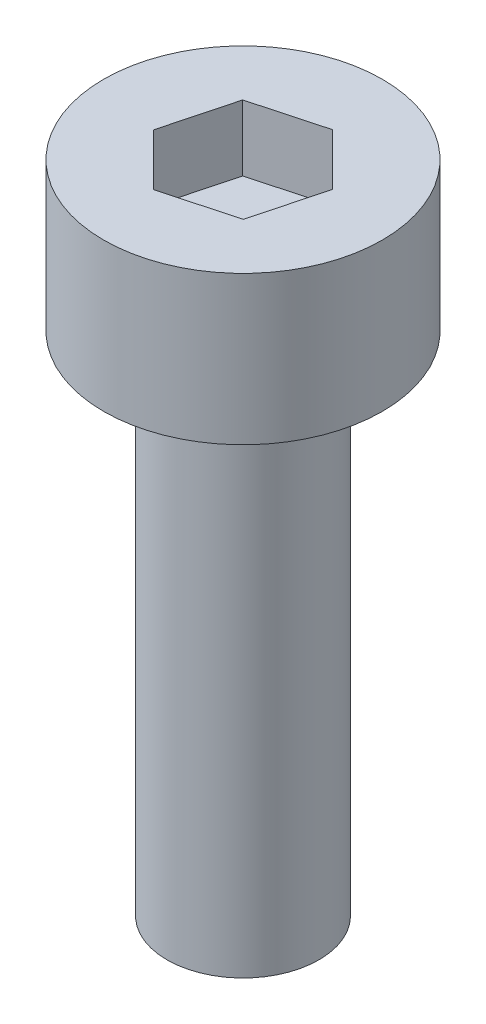
ISO-10303-21;
HEADER;
FILE_DESCRIPTION(('STEP AP214'),'2;1');
FILE_NAME('part.step','',(''),(''),'','','');
FILE_SCHEMA(('AUTOMOTIVE_DESIGN { 1 0 10303 214 1 1 1 1 }'));
ENDSEC;
DATA;
#1=APPLICATION_CONTEXT('core data for automotive mechanical design processes');
#2=APPLICATION_PROTOCOL_DEFINITION('international standard','automotive_design',2000,#1);
#3=PRODUCT_CONTEXT('',#1,'mechanical');
#4=PRODUCT('Part','Part','',(#3));
#5=PRODUCT_RELATED_PRODUCT_CATEGORY('part','',(#4));
#6=PRODUCT_DEFINITION_FORMATION('','',#4);
#7=PRODUCT_DEFINITION_CONTEXT('part definition',#1,'design');
#8=PRODUCT_DEFINITION('design','',#6,#7);
#9=PRODUCT_DEFINITION_SHAPE('','',#8);
#10=(LENGTH_UNIT() NAMED_UNIT(*) SI_UNIT(.MILLI.,.METRE.));
#11=(NAMED_UNIT(*) PLANE_ANGLE_UNIT() SI_UNIT($,.RADIAN.));
#12=(NAMED_UNIT(*) SI_UNIT($,.STERADIAN.) SOLID_ANGLE_UNIT());
#13=UNCERTAINTY_MEASURE_WITH_UNIT(LENGTH_MEASURE(1.E-05),#10,'distance_accuracy_value','');
#14=(GEOMETRIC_REPRESENTATION_CONTEXT(3) GLOBAL_UNCERTAINTY_ASSIGNED_CONTEXT((#13)) GLOBAL_UNIT_ASSIGNED_CONTEXT((#10,
#11,#12)) REPRESENTATION_CONTEXT('',''));
#15=CARTESIAN_POINT('',(0.,0.,0.));
#16=DIRECTION('',(0.,0.,1.));
#17=DIRECTION('',(1.,0.,0.));
#18=AXIS2_PLACEMENT_3D('',#15,#16,#17);
#19=CARTESIAN_POINT('',(0.,10.,0.));
#20=DIRECTION('',(0.,-1.,0.));
#21=DIRECTION('',(0.,0.,-1.));
#22=AXIS2_PLACEMENT_3D('',#19,#20,#21);
#23=CYLINDRICAL_SURFACE('',#22,1.5);
#24=CARTESIAN_POINT('',(0.,10.,0.));
#25=DIRECTION('',(0.,1.,0.));
#26=DIRECTION('',(0.,0.,1.));
#27=AXIS2_PLACEMENT_3D('',#24,#25,#26);
#28=CIRCLE('',#27,1.5);
#29=CARTESIAN_POINT('',(0.,10.,1.5));
#30=VERTEX_POINT('',#29);
#31=EDGE_CURVE('E11',#30,#30,#28,.T.);
#32=ORIENTED_EDGE('',*,*,#31,.F.);
#33=EDGE_LOOP('',(#32));
#34=FACE_BOUND('',#33,.T.);
#35=CARTESIAN_POINT('',(0.,0.,0.));
#36=DIRECTION('',(0.,1.,0.));
#37=DIRECTION('',(0.,0.,1.));
#38=AXIS2_PLACEMENT_3D('',#35,#36,#37);
#39=CIRCLE('',#38,1.5);
#40=CARTESIAN_POINT('',(0.,0.,1.5));
#41=VERTEX_POINT('',#40);
#42=EDGE_CURVE('E42',#41,#41,#39,.T.);
#43=ORIENTED_EDGE('',*,*,#42,.T.);
#44=EDGE_LOOP('',(#43));
#45=FACE_BOUND('',#44,.T.);
#46=ADVANCED_FACE('F39',(#34,#45),#23,.T.);
#47=CARTESIAN_POINT('',(0.,0.,0.));
#48=DIRECTION('',(0.,1.,0.));
#49=DIRECTION('',(0.,0.,1.));
#50=AXIS2_PLACEMENT_3D('',#47,#48,#49);
#51=PLANE('',#50);
#52=ORIENTED_EDGE('',*,*,#42,.F.);
#53=EDGE_LOOP('',(#52));
#54=FACE_BOUND('',#53,.T.);
#55=ADVANCED_FACE('F189',(#54),#51,.F.);
#56=CARTESIAN_POINT('',(0.,12.93,0.));
#57=DIRECTION('',(0.,-1.,0.));
#58=DIRECTION('',(0.,0.,-1.));
#59=AXIS2_PLACEMENT_3D('',#56,#57,#58);
#60=CYLINDRICAL_SURFACE('',#59,2.75);
#61=CARTESIAN_POINT('',(0.,12.93,0.));
#62=DIRECTION('',(0.,1.,0.));
#63=DIRECTION('',(0.,0.,1.));
#64=AXIS2_PLACEMENT_3D('',#61,#62,#63);
#65=CIRCLE('',#64,2.75);
#66=CARTESIAN_POINT('',(0.,12.93,2.75));
#67=VERTEX_POINT('',#66);
#68=EDGE_CURVE('E163',#67,#67,#65,.T.);
#69=ORIENTED_EDGE('',*,*,#68,.F.);
#70=EDGE_LOOP('',(#69));
#71=FACE_BOUND('',#70,.T.);
#72=CARTESIAN_POINT('',(0.,10.,0.));
#73=DIRECTION('',(0.,1.,0.));
#74=DIRECTION('',(0.,0.,1.));
#75=AXIS2_PLACEMENT_3D('',#72,#73,#74);
#76=CIRCLE('',#75,2.75);
#77=CARTESIAN_POINT('',(0.,10.,2.75));
#78=VERTEX_POINT('',#77);
#79=EDGE_CURVE('E153',#78,#78,#76,.T.);
#80=ORIENTED_EDGE('',*,*,#79,.T.);
#81=EDGE_LOOP('',(#80));
#82=FACE_BOUND('',#81,.T.);
#83=ADVANCED_FACE('F171',(#71,#82),#60,.T.);
#84=CARTESIAN_POINT('',(0.,12.93,0.));
#85=DIRECTION('',(0.,1.,0.));
#86=DIRECTION('',(0.,0.,1.));
#87=AXIS2_PLACEMENT_3D('',#84,#85,#86);
#88=PLANE('',#87);
#89=DIRECTION('',(0.965060636483616,0.,-0.262026654960595));
#90=VECTOR('',#89,1.);
#91=CARTESIAN_POINT('',(-0.368939204121915,12.93,1.39542724532497));
#92=LINE('',#91,#90);
#93=CARTESIAN_POINT('',(-0.368939204121915,12.93,1.39542724532497));
#94=VERTEX_POINT('',#93);
#95=CARTESIAN_POINT('',(1.0240058415234,12.93,1.01722434588407));
#96=VERTEX_POINT('',#95);
#97=EDGE_CURVE('E54',#94,#96,#92,.T.);
#98=ORIENTED_EDGE('',*,*,#97,.F.);
#99=DIRECTION('',(0.709452057906343,0.,0.704753699906893));
#100=VECTOR('',#99,1.);
#101=CARTESIAN_POINT('',(-1.39294504564532,12.93,0.378202899440891));
#102=LINE('',#101,#100);
#103=CARTESIAN_POINT('',(-1.39294504564532,12.93,0.378202899440891));
#104=VERTEX_POINT('',#103);
#105=EDGE_CURVE('E147',#104,#94,#102,.T.);
#106=ORIENTED_EDGE('',*,*,#105,.F.);
#107=DIRECTION('',(-0.255608578577273,0.,0.966780354867488));
#108=VECTOR('',#107,1.);
#109=CARTESIAN_POINT('',(-1.0240058415234,12.93,-1.01722434588407));
#110=LINE('',#109,#108);
#111=CARTESIAN_POINT('',(-1.0240058415234,12.93,-1.01722434588407));
#112=VERTEX_POINT('',#111);
#113=EDGE_CURVE('E144',#112,#104,#110,.T.);
#114=ORIENTED_EDGE('',*,*,#113,.F.);
#115=DIRECTION('',(-0.965060636483616,0.,0.262026654960595));
#116=VECTOR('',#115,1.);
#117=CARTESIAN_POINT('',(0.368939204121915,12.93,-1.39542724532496));
#118=LINE('',#117,#116);
#119=CARTESIAN_POINT('',(0.368939204121915,12.93,-1.39542724532496));
#120=VERTEX_POINT('',#119);
#121=EDGE_CURVE('E102',#120,#112,#118,.T.);
#122=ORIENTED_EDGE('',*,*,#121,.F.);
#123=DIRECTION('',(-0.709452057906343,0.,-0.704753699906893));
#124=VECTOR('',#123,1.);
#125=CARTESIAN_POINT('',(1.39294504564532,12.93,-0.378202899440891));
#126=LINE('',#125,#124);
#127=CARTESIAN_POINT('',(1.39294504564532,12.93,-0.378202899440891));
#128=VERTEX_POINT('',#127);
#129=EDGE_CURVE('E138',#128,#120,#126,.T.);
#130=ORIENTED_EDGE('',*,*,#129,.F.);
#131=DIRECTION('',(0.255608578577273,0.,-0.966780354867488));
#132=VECTOR('',#131,1.);
#133=CARTESIAN_POINT('',(1.0240058415234,12.93,1.01722434588407));
#134=LINE('',#133,#132);
#135=EDGE_CURVE('E134',#96,#128,#134,.T.);
#136=ORIENTED_EDGE('',*,*,#135,.F.);
#137=EDGE_LOOP('',(#98,#106,#114,#122,#130,#136));
#138=FACE_BOUND('',#137,.T.);
#139=ORIENTED_EDGE('',*,*,#68,.T.);
#140=EDGE_LOOP('',(#139));
#141=FACE_BOUND('',#140,.T.);
#142=ADVANCED_FACE('F176',(#138,#141),#88,.T.);
#143=CARTESIAN_POINT('',(0.,10.,0.));
#144=DIRECTION('',(0.,1.,0.));
#145=DIRECTION('',(0.,0.,1.));
#146=AXIS2_PLACEMENT_3D('',#143,#144,#145);
#147=PLANE('',#146);
#148=ORIENTED_EDGE('',*,*,#31,.T.);
#149=EDGE_LOOP('',(#148));
#150=FACE_BOUND('',#149,.T.);
#151=ORIENTED_EDGE('',*,*,#79,.F.);
#152=EDGE_LOOP('',(#151));
#153=FACE_BOUND('',#152,.T.);
#154=ADVANCED_FACE('F173',(#150,#153),#147,.F.);
#155=CARTESIAN_POINT('',(-0.368939204121915,11.63,1.39542724532497));
#156=DIRECTION('',(0.262026654960595,0.,0.965060636483616));
#157=DIRECTION('',(0.965060636483616,0.,-0.262026654960595));
#158=AXIS2_PLACEMENT_3D('',#155,#156,#157);
#159=PLANE('',#158);
#160=ORIENTED_EDGE('',*,*,#97,.T.);
#161=DIRECTION('',(0.,1.,0.));
#162=VECTOR('',#161,1.);
#163=CARTESIAN_POINT('',(1.0240058415234,11.63,1.01722434588407));
#164=LINE('',#163,#162);
#165=CARTESIAN_POINT('',(1.0240058415234,11.63,1.01722434588407));
#166=VERTEX_POINT('',#165);
#167=EDGE_CURVE('E84',#166,#96,#164,.T.);
#168=ORIENTED_EDGE('',*,*,#167,.F.);
#169=DIRECTION('',(0.965060636483616,0.,-0.262026654960595));
#170=VECTOR('',#169,1.);
#171=CARTESIAN_POINT('',(-0.368939204121915,11.63,1.39542724532497));
#172=LINE('',#171,#170);
#173=CARTESIAN_POINT('',(-0.368939204121915,11.63,1.39542724532497));
#174=VERTEX_POINT('',#173);
#175=EDGE_CURVE('E150',#174,#166,#172,.T.);
#176=ORIENTED_EDGE('',*,*,#175,.F.);
#177=DIRECTION('',(0.,1.,0.));
#178=VECTOR('',#177,1.);
#179=CARTESIAN_POINT('',(-0.368939204121915,11.63,1.39542724532497));
#180=LINE('',#179,#178);
#181=EDGE_CURVE('E62',#174,#94,#180,.T.);
#182=ORIENTED_EDGE('',*,*,#181,.T.);
#183=EDGE_LOOP('',(#160,#168,#176,#182));
#184=FACE_BOUND('',#183,.T.);
#185=ADVANCED_FACE('F175',(#184),#159,.F.);
#186=CARTESIAN_POINT('',(-1.39294504564532,11.63,0.378202899440891));
#187=DIRECTION('',(-0.704753699906893,0.,0.709452057906343));
#188=DIRECTION('',(0.709452057906343,0.,0.704753699906893));
#189=AXIS2_PLACEMENT_3D('',#186,#187,#188);
#190=PLANE('',#189);
#191=ORIENTED_EDGE('',*,*,#105,.T.);
#192=ORIENTED_EDGE('',*,*,#181,.F.);
#193=DIRECTION('',(0.709452057906343,0.,0.704753699906893));
#194=VECTOR('',#193,1.);
#195=CARTESIAN_POINT('',(-1.39294504564532,11.63,0.378202899440891));
#196=LINE('',#195,#194);
#197=CARTESIAN_POINT('',(-1.39294504564532,11.63,0.378202899440891));
#198=VERTEX_POINT('',#197);
#199=EDGE_CURVE('E116',#198,#174,#196,.T.);
#200=ORIENTED_EDGE('',*,*,#199,.F.);
#201=DIRECTION('',(0.,1.,0.));
#202=VECTOR('',#201,1.);
#203=CARTESIAN_POINT('',(-1.39294504564532,11.63,0.378202899440891));
#204=LINE('',#203,#202);
#205=EDGE_CURVE('E107',#198,#104,#204,.T.);
#206=ORIENTED_EDGE('',*,*,#205,.T.);
#207=EDGE_LOOP('',(#191,#192,#200,#206));
#208=FACE_BOUND('',#207,.T.);
#209=ADVANCED_FACE('F183',(#208),#190,.F.);
#210=CARTESIAN_POINT('',(-1.0240058415234,11.63,-1.01722434588407));
#211=DIRECTION('',(-0.966780354867488,0.,-0.255608578577273));
#212=DIRECTION('',(-0.255608578577273,0.,0.966780354867488));
#213=AXIS2_PLACEMENT_3D('',#210,#211,#212);
#214=PLANE('',#213);
#215=ORIENTED_EDGE('',*,*,#113,.T.);
#216=ORIENTED_EDGE('',*,*,#205,.F.);
#217=DIRECTION('',(-0.255608578577273,0.,0.966780354867488));
#218=VECTOR('',#217,1.);
#219=CARTESIAN_POINT('',(-1.0240058415234,11.63,-1.01722434588407));
#220=LINE('',#219,#218);
#221=CARTESIAN_POINT('',(-1.0240058415234,11.63,-1.01722434588407));
#222=VERTEX_POINT('',#221);
#223=EDGE_CURVE('E111',#222,#198,#220,.T.);
#224=ORIENTED_EDGE('',*,*,#223,.F.);
#225=DIRECTION('',(0.,1.,0.));
#226=VECTOR('',#225,1.);
#227=CARTESIAN_POINT('',(-1.0240058415234,11.63,-1.01722434588407));
#228=LINE('',#227,#226);
#229=EDGE_CURVE('E95',#222,#112,#228,.T.);
#230=ORIENTED_EDGE('',*,*,#229,.T.);
#231=EDGE_LOOP('',(#215,#216,#224,#230));
#232=FACE_BOUND('',#231,.T.);
#233=ADVANCED_FACE('F112',(#232),#214,.F.);
#234=CARTESIAN_POINT('',(0.368939204121915,11.63,-1.39542724532496));
#235=DIRECTION('',(-0.262026654960595,0.,-0.965060636483616));
#236=DIRECTION('',(-0.965060636483616,0.,0.262026654960595));
#237=AXIS2_PLACEMENT_3D('',#234,#235,#236);
#238=PLANE('',#237);
#239=ORIENTED_EDGE('',*,*,#121,.T.);
#240=ORIENTED_EDGE('',*,*,#229,.F.);
#241=DIRECTION('',(-0.965060636483616,0.,0.262026654960595));
#242=VECTOR('',#241,1.);
#243=CARTESIAN_POINT('',(0.368939204121915,11.63,-1.39542724532496));
#244=LINE('',#243,#242);
#245=CARTESIAN_POINT('',(0.368939204121915,11.63,-1.39542724532496));
#246=VERTEX_POINT('',#245);
#247=EDGE_CURVE('E99',#246,#222,#244,.T.);
#248=ORIENTED_EDGE('',*,*,#247,.F.);
#249=DIRECTION('',(0.,1.,0.));
#250=VECTOR('',#249,1.);
#251=CARTESIAN_POINT('',(0.368939204121915,11.63,-1.39542724532496));
#252=LINE('',#251,#250);
#253=EDGE_CURVE('E108',#246,#120,#252,.T.);
#254=ORIENTED_EDGE('',*,*,#253,.T.);
#255=EDGE_LOOP('',(#239,#240,#248,#254));
#256=FACE_BOUND('',#255,.T.);
#257=ADVANCED_FACE('F97',(#256),#238,.F.);
#258=CARTESIAN_POINT('',(1.39294504564532,11.63,-0.378202899440891));
#259=DIRECTION('',(0.704753699906893,0.,-0.709452057906343));
#260=DIRECTION('',(-0.709452057906343,0.,-0.704753699906893));
#261=AXIS2_PLACEMENT_3D('',#258,#259,#260);
#262=PLANE('',#261);
#263=ORIENTED_EDGE('',*,*,#129,.T.);
#264=ORIENTED_EDGE('',*,*,#253,.F.);
#265=DIRECTION('',(-0.709452057906343,0.,-0.704753699906893));
#266=VECTOR('',#265,1.);
#267=CARTESIAN_POINT('',(1.39294504564532,11.63,-0.378202899440891));
#268=LINE('',#267,#266);
#269=CARTESIAN_POINT('',(1.39294504564532,11.63,-0.378202899440891));
#270=VERTEX_POINT('',#269);
#271=EDGE_CURVE('E122',#270,#246,#268,.T.);
#272=ORIENTED_EDGE('',*,*,#271,.F.);
#273=DIRECTION('',(0.,1.,0.));
#274=VECTOR('',#273,1.);
#275=CARTESIAN_POINT('',(1.39294504564532,11.63,-0.378202899440891));
#276=LINE('',#275,#274);
#277=EDGE_CURVE('E158',#270,#128,#276,.T.);
#278=ORIENTED_EDGE('',*,*,#277,.T.);
#279=EDGE_LOOP('',(#263,#264,#272,#278));
#280=FACE_BOUND('',#279,.T.);
#281=ADVANCED_FACE('F245',(#280),#262,.F.);
#282=CARTESIAN_POINT('',(1.0240058415234,11.63,1.01722434588407));
#283=DIRECTION('',(0.966780354867488,0.,0.255608578577273));
#284=DIRECTION('',(0.255608578577273,0.,-0.966780354867488));
#285=AXIS2_PLACEMENT_3D('',#282,#283,#284);
#286=PLANE('',#285);
#287=ORIENTED_EDGE('',*,*,#135,.T.);
#288=ORIENTED_EDGE('',*,*,#277,.F.);
#289=DIRECTION('',(0.255608578577273,0.,-0.966780354867488));
#290=VECTOR('',#289,1.);
#291=CARTESIAN_POINT('',(1.0240058415234,11.63,1.01722434588407));
#292=LINE('',#291,#290);
#293=EDGE_CURVE('E126',#166,#270,#292,.T.);
#294=ORIENTED_EDGE('',*,*,#293,.F.);
#295=ORIENTED_EDGE('',*,*,#167,.T.);
#296=EDGE_LOOP('',(#287,#288,#294,#295));
#297=FACE_BOUND('',#296,.T.);
#298=ADVANCED_FACE('F254',(#297),#286,.F.);
#299=CARTESIAN_POINT('',(0.,11.63,0.));
#300=DIRECTION('',(0.,1.,0.));
#301=DIRECTION('',(0.,0.,1.));
#302=AXIS2_PLACEMENT_3D('',#299,#300,#301);
#303=PLANE('',#302);
#304=ORIENTED_EDGE('',*,*,#175,.T.);
#305=ORIENTED_EDGE('',*,*,#293,.T.);
#306=ORIENTED_EDGE('',*,*,#271,.T.);
#307=ORIENTED_EDGE('',*,*,#247,.T.);
#308=ORIENTED_EDGE('',*,*,#223,.T.);
#309=ORIENTED_EDGE('',*,*,#199,.T.);
#310=EDGE_LOOP('',(#304,#305,#306,#307,#308,#309));
#311=FACE_BOUND('',#310,.T.);
#312=ADVANCED_FACE('F119',(#311),#303,.T.);
#313=CLOSED_SHELL('',(#46,#55,#83,#142,#154,#185,#209,#233,#257,#281,#298,#312));
#314=MANIFOLD_SOLID_BREP('B2',#313);
#315=ADVANCED_BREP_SHAPE_REPRESENTATION('',(#18,#314),#14);
#316=SHAPE_DEFINITION_REPRESENTATION(#9,#315);
ENDSEC;
END-ISO-10303-21;
